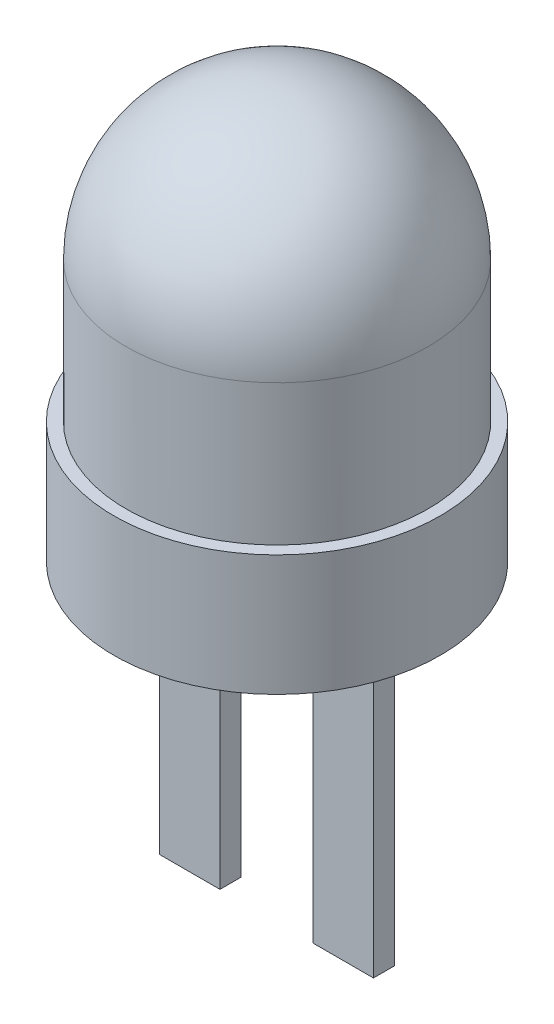
ISO-10303-21;
HEADER;
FILE_DESCRIPTION(('STEP AP214'),'2;1');
FILE_NAME('part.step','',(''),(''),'','','');
FILE_SCHEMA(('AUTOMOTIVE_DESIGN { 1 0 10303 214 1 1 1 1 }'));
ENDSEC;
DATA;
#1=APPLICATION_CONTEXT('core data for automotive mechanical design processes');
#2=APPLICATION_PROTOCOL_DEFINITION('international standard','automotive_design',2000,#1);
#3=PRODUCT_CONTEXT('',#1,'mechanical');
#4=PRODUCT('Part','Part','',(#3));
#5=PRODUCT_RELATED_PRODUCT_CATEGORY('part','',(#4));
#6=PRODUCT_DEFINITION_FORMATION('','',#4);
#7=PRODUCT_DEFINITION_CONTEXT('part definition',#1,'design');
#8=PRODUCT_DEFINITION('design','',#6,#7);
#9=PRODUCT_DEFINITION_SHAPE('','',#8);
#10=(LENGTH_UNIT() NAMED_UNIT(*) SI_UNIT(.MILLI.,.METRE.));
#11=(NAMED_UNIT(*) PLANE_ANGLE_UNIT() SI_UNIT($,.RADIAN.));
#12=(NAMED_UNIT(*) SI_UNIT($,.STERADIAN.) SOLID_ANGLE_UNIT());
#13=UNCERTAINTY_MEASURE_WITH_UNIT(LENGTH_MEASURE(1.E-05),#10,'distance_accuracy_value','');
#14=(GEOMETRIC_REPRESENTATION_CONTEXT(3) GLOBAL_UNCERTAINTY_ASSIGNED_CONTEXT((#13)) GLOBAL_UNIT_ASSIGNED_CONTEXT((#10,
#11,#12)) REPRESENTATION_CONTEXT('',''));
#15=CARTESIAN_POINT('',(0.,0.,0.));
#16=DIRECTION('',(0.,0.,1.));
#17=DIRECTION('',(1.,0.,0.));
#18=AXIS2_PLACEMENT_3D('',#15,#16,#17);
#19=CARTESIAN_POINT('',(0.,0.,0.));
#20=DIRECTION('',(0.,-1.,0.));
#21=DIRECTION('',(0.,0.,-1.));
#22=AXIS2_PLACEMENT_3D('',#19,#20,#21);
#23=PLANE('',#22);
#24=DIRECTION('',(0.,0.,1.));
#25=VECTOR('',#24,1.);
#26=CARTESIAN_POINT('',(-0.77,0.,0.));
#27=LINE('',#26,#25);
#28=CARTESIAN_POINT('',(-0.77,0.,-0.175));
#29=VERTEX_POINT('',#28);
#30=CARTESIAN_POINT('',(-0.77,0.,0.175));
#31=VERTEX_POINT('',#30);
#32=EDGE_CURVE('E11',#29,#31,#27,.T.);
#33=ORIENTED_EDGE('',*,*,#32,.F.);
#34=DIRECTION('',(1.,0.,0.));
#35=VECTOR('',#34,1.);
#36=CARTESIAN_POINT('',(0.,0.,-0.175));
#37=LINE('',#36,#35);
#38=CARTESIAN_POINT('',(-1.77,0.,-0.175));
#39=VERTEX_POINT('',#38);
#40=EDGE_CURVE('E40',#39,#29,#37,.T.);
#41=ORIENTED_EDGE('',*,*,#40,.F.);
#42=DIRECTION('',(0.,0.,-1.));
#43=VECTOR('',#42,1.);
#44=CARTESIAN_POINT('',(-1.77,0.,0.));
#45=LINE('',#44,#43);
#46=CARTESIAN_POINT('',(-1.77,0.,0.175));
#47=VERTEX_POINT('',#46);
#48=EDGE_CURVE('E170',#47,#39,#45,.T.);
#49=ORIENTED_EDGE('',*,*,#48,.F.);
#50=DIRECTION('',(-1.,0.,0.));
#51=VECTOR('',#50,1.);
#52=CARTESIAN_POINT('',(0.,0.,0.175));
#53=LINE('',#52,#51);
#54=EDGE_CURVE('E168',#31,#47,#53,.T.);
#55=ORIENTED_EDGE('',*,*,#54,.F.);
#56=EDGE_LOOP('',(#33,#41,#49,#55));
#57=FACE_BOUND('',#56,.T.);
#58=DIRECTION('',(0.,0.,-1.));
#59=VECTOR('',#58,1.);
#60=CARTESIAN_POINT('',(0.77,0.,0.));
#61=LINE('',#60,#59);
#62=CARTESIAN_POINT('',(0.77,0.,0.175));
#63=VERTEX_POINT('',#62);
#64=CARTESIAN_POINT('',(0.77,0.,-0.175));
#65=VERTEX_POINT('',#64);
#66=EDGE_CURVE('E165',#63,#65,#61,.T.);
#67=ORIENTED_EDGE('',*,*,#66,.F.);
#68=DIRECTION('',(-1.,0.,0.));
#69=VECTOR('',#68,1.);
#70=CARTESIAN_POINT('',(0.,0.,0.175));
#71=LINE('',#70,#69);
#72=CARTESIAN_POINT('',(1.77,0.,0.175));
#73=VERTEX_POINT('',#72);
#74=EDGE_CURVE('E162',#73,#63,#71,.T.);
#75=ORIENTED_EDGE('',*,*,#74,.F.);
#76=DIRECTION('',(0.,0.,1.));
#77=VECTOR('',#76,1.);
#78=CARTESIAN_POINT('',(1.77,0.,0.));
#79=LINE('',#78,#77);
#80=CARTESIAN_POINT('',(1.77,0.,-0.175));
#81=VERTEX_POINT('',#80);
#82=EDGE_CURVE('E159',#81,#73,#79,.T.);
#83=ORIENTED_EDGE('',*,*,#82,.F.);
#84=DIRECTION('',(1.,0.,0.));
#85=VECTOR('',#84,1.);
#86=CARTESIAN_POINT('',(0.,0.,-0.175));
#87=LINE('',#86,#85);
#88=EDGE_CURVE('E156',#65,#81,#87,.T.);
#89=ORIENTED_EDGE('',*,*,#88,.F.);
#90=EDGE_LOOP('',(#67,#75,#83,#89));
#91=FACE_BOUND('',#90,.T.);
#92=CARTESIAN_POINT('',(0.,0.,0.));
#93=DIRECTION('',(0.,-1.,0.));
#94=DIRECTION('',(0.,0.,-1.));
#95=AXIS2_PLACEMENT_3D('',#92,#93,#94);
#96=CIRCLE('',#95,2.7);
#97=CARTESIAN_POINT('',(0.,0.,-2.7));
#98=VERTEX_POINT('',#97);
#99=EDGE_CURVE('E153',#98,#98,#96,.T.);
#100=ORIENTED_EDGE('',*,*,#99,.T.);
#101=EDGE_LOOP('',(#100));
#102=FACE_BOUND('',#101,.T.);
#103=ADVANCED_FACE('F33',(#57,#91,#102),#23,.T.);
#104=CARTESIAN_POINT('',(0.,0.,0.));
#105=DIRECTION('',(0.,-1.,0.));
#106=DIRECTION('',(0.,0.,-1.));
#107=AXIS2_PLACEMENT_3D('',#104,#105,#106);
#108=CYLINDRICAL_SURFACE('',#107,2.7);
#109=CARTESIAN_POINT('',(0.,2.,0.));
#110=DIRECTION('',(0.,-1.,0.));
#111=DIRECTION('',(0.,0.,-1.));
#112=AXIS2_PLACEMENT_3D('',#109,#110,#111);
#113=CIRCLE('',#112,2.7);
#114=CARTESIAN_POINT('',(0.,2.,-2.7));
#115=VERTEX_POINT('',#114);
#116=EDGE_CURVE('E150',#115,#115,#113,.T.);
#117=ORIENTED_EDGE('',*,*,#116,.T.);
#118=EDGE_LOOP('',(#117));
#119=FACE_BOUND('',#118,.T.);
#120=ORIENTED_EDGE('',*,*,#99,.F.);
#121=EDGE_LOOP('',(#120));
#122=FACE_BOUND('',#121,.T.);
#123=ADVANCED_FACE('F178',(#119,#122),#108,.T.);
#124=CARTESIAN_POINT('',(2.7,2.,0.));
#125=DIRECTION('',(0.,1.,0.));
#126=DIRECTION('',(0.,0.,1.));
#127=AXIS2_PLACEMENT_3D('',#124,#125,#126);
#128=PLANE('',#127);
#129=CARTESIAN_POINT('',(0.,2.,0.));
#130=DIRECTION('',(0.,-1.,0.));
#131=DIRECTION('',(0.,0.,-1.));
#132=AXIS2_PLACEMENT_3D('',#129,#130,#131);
#133=CIRCLE('',#132,2.5);
#134=CARTESIAN_POINT('',(0.,2.,-2.5));
#135=VERTEX_POINT('',#134);
#136=EDGE_CURVE('E147',#135,#135,#133,.T.);
#137=ORIENTED_EDGE('',*,*,#136,.T.);
#138=EDGE_LOOP('',(#137));
#139=FACE_BOUND('',#138,.T.);
#140=ORIENTED_EDGE('',*,*,#116,.F.);
#141=EDGE_LOOP('',(#140));
#142=FACE_BOUND('',#141,.T.);
#143=ADVANCED_FACE('F183',(#139,#142),#128,.T.);
#144=CARTESIAN_POINT('',(0.,0.,0.));
#145=DIRECTION('',(0.,-1.,0.));
#146=DIRECTION('',(0.,0.,-1.));
#147=AXIS2_PLACEMENT_3D('',#144,#145,#146);
#148=CYLINDRICAL_SURFACE('',#147,2.5);
#149=CARTESIAN_POINT('',(0.,4.325,0.));
#150=DIRECTION('',(0.,-1.,0.));
#151=DIRECTION('',(0.,0.,-1.));
#152=AXIS2_PLACEMENT_3D('',#149,#150,#151);
#153=CIRCLE('',#152,2.5);
#154=CARTESIAN_POINT('',(0.,4.325,-2.5));
#155=VERTEX_POINT('',#154);
#156=EDGE_CURVE('E139',#155,#155,#153,.T.);
#157=ORIENTED_EDGE('',*,*,#156,.T.);
#158=EDGE_LOOP('',(#157));
#159=FACE_BOUND('',#158,.T.);
#160=ORIENTED_EDGE('',*,*,#136,.F.);
#161=EDGE_LOOP('',(#160));
#162=FACE_BOUND('',#161,.T.);
#163=ADVANCED_FACE('F188',(#159,#162),#148,.T.);
#164=CARTESIAN_POINT('',(0.,4.325,0.));
#165=DIRECTION('',(0.,-1.,0.));
#166=DIRECTION('',(1.,0.,0.));
#167=AXIS2_PLACEMENT_3D('',#164,#165,#166);
#168=SPHERICAL_SURFACE('',#167,2.5);
#169=ORIENTED_EDGE('',*,*,#156,.F.);
#170=EDGE_LOOP('',(#169));
#171=FACE_BOUND('',#170,.T.);
#172=ADVANCED_FACE('F194',(#171),#168,.T.);
#173=CARTESIAN_POINT('',(0.77,5.,0.175));
#174=DIRECTION('',(-1.,0.,0.));
#175=DIRECTION('',(0.,0.,1.));
#176=AXIS2_PLACEMENT_3D('',#173,#174,#175);
#177=PLANE('',#176);
#178=DIRECTION('',(0.,-1.,0.));
#179=VECTOR('',#178,1.);
#180=CARTESIAN_POINT('',(0.77,5.,0.175));
#181=LINE('',#180,#179);
#182=CARTESIAN_POINT('',(0.77,-5.,0.175));
#183=VERTEX_POINT('',#182);
#184=EDGE_CURVE('E137',#63,#183,#181,.T.);
#185=ORIENTED_EDGE('',*,*,#184,.F.);
#186=ORIENTED_EDGE('',*,*,#66,.T.);
#187=DIRECTION('',(0.,-1.,0.));
#188=VECTOR('',#187,1.);
#189=CARTESIAN_POINT('',(0.77,5.,-0.175));
#190=LINE('',#189,#188);
#191=CARTESIAN_POINT('',(0.77,-5.,-0.175));
#192=VERTEX_POINT('',#191);
#193=EDGE_CURVE('E136',#65,#192,#190,.T.);
#194=ORIENTED_EDGE('',*,*,#193,.T.);
#195=DIRECTION('',(0.,0.,-1.));
#196=VECTOR('',#195,1.);
#197=CARTESIAN_POINT('',(0.77,-5.,0.175));
#198=LINE('',#197,#196);
#199=EDGE_CURVE('E121',#183,#192,#198,.T.);
#200=ORIENTED_EDGE('',*,*,#199,.F.);
#201=EDGE_LOOP('',(#185,#186,#194,#200));
#202=FACE_BOUND('',#201,.T.);
#203=ADVANCED_FACE('F198',(#202),#177,.T.);
#204=CARTESIAN_POINT('',(0.77,5.,0.175));
#205=DIRECTION('',(0.,0.,1.));
#206=DIRECTION('',(1.,0.,0.));
#207=AXIS2_PLACEMENT_3D('',#204,#205,#206);
#208=PLANE('',#207);
#209=DIRECTION('',(0.,-1.,0.));
#210=VECTOR('',#209,1.);
#211=CARTESIAN_POINT('',(1.77,5.,0.175));
#212=LINE('',#211,#210);
#213=CARTESIAN_POINT('',(1.77,-5.,0.175));
#214=VERTEX_POINT('',#213);
#215=EDGE_CURVE('E140',#73,#214,#212,.T.);
#216=ORIENTED_EDGE('',*,*,#215,.F.);
#217=ORIENTED_EDGE('',*,*,#74,.T.);
#218=ORIENTED_EDGE('',*,*,#184,.T.);
#219=DIRECTION('',(-1.,0.,0.));
#220=VECTOR('',#219,1.);
#221=CARTESIAN_POINT('',(0.77,-5.,0.175));
#222=LINE('',#221,#220);
#223=EDGE_CURVE('E133',#214,#183,#222,.T.);
#224=ORIENTED_EDGE('',*,*,#223,.F.);
#225=EDGE_LOOP('',(#216,#217,#218,#224));
#226=FACE_BOUND('',#225,.T.);
#227=ADVANCED_FACE('F202',(#226),#208,.T.);
#228=CARTESIAN_POINT('',(1.77,5.,0.175));
#229=DIRECTION('',(1.,0.,0.));
#230=DIRECTION('',(0.,0.,-1.));
#231=AXIS2_PLACEMENT_3D('',#228,#229,#230);
#232=PLANE('',#231);
#233=DIRECTION('',(0.,-1.,0.));
#234=VECTOR('',#233,1.);
#235=CARTESIAN_POINT('',(1.77,5.,-0.175));
#236=LINE('',#235,#234);
#237=CARTESIAN_POINT('',(1.77,-5.,-0.175));
#238=VERTEX_POINT('',#237);
#239=EDGE_CURVE('E142',#81,#238,#236,.T.);
#240=ORIENTED_EDGE('',*,*,#239,.F.);
#241=ORIENTED_EDGE('',*,*,#82,.T.);
#242=ORIENTED_EDGE('',*,*,#215,.T.);
#243=DIRECTION('',(0.,0.,1.));
#244=VECTOR('',#243,1.);
#245=CARTESIAN_POINT('',(1.77,-5.,0.175));
#246=LINE('',#245,#244);
#247=EDGE_CURVE('E130',#238,#214,#246,.T.);
#248=ORIENTED_EDGE('',*,*,#247,.F.);
#249=EDGE_LOOP('',(#240,#241,#242,#248));
#250=FACE_BOUND('',#249,.T.);
#251=ADVANCED_FACE('F208',(#250),#232,.T.);
#252=CARTESIAN_POINT('',(0.77,5.,-0.175));
#253=DIRECTION('',(0.,0.,-1.));
#254=DIRECTION('',(-1.,0.,0.));
#255=AXIS2_PLACEMENT_3D('',#252,#253,#254);
#256=PLANE('',#255);
#257=ORIENTED_EDGE('',*,*,#193,.F.);
#258=ORIENTED_EDGE('',*,*,#88,.T.);
#259=ORIENTED_EDGE('',*,*,#239,.T.);
#260=DIRECTION('',(1.,0.,0.));
#261=VECTOR('',#260,1.);
#262=CARTESIAN_POINT('',(0.77,-5.,-0.175));
#263=LINE('',#262,#261);
#264=EDGE_CURVE('E127',#192,#238,#263,.T.);
#265=ORIENTED_EDGE('',*,*,#264,.F.);
#266=EDGE_LOOP('',(#257,#258,#259,#265));
#267=FACE_BOUND('',#266,.T.);
#268=ADVANCED_FACE('F204',(#267),#256,.T.);
#269=CARTESIAN_POINT('',(0.,-5.,0.));
#270=DIRECTION('',(0.,-1.,0.));
#271=DIRECTION('',(0.,0.,-1.));
#272=AXIS2_PLACEMENT_3D('',#269,#270,#271);
#273=PLANE('',#272);
#274=ORIENTED_EDGE('',*,*,#199,.T.);
#275=ORIENTED_EDGE('',*,*,#264,.T.);
#276=ORIENTED_EDGE('',*,*,#247,.T.);
#277=ORIENTED_EDGE('',*,*,#223,.T.);
#278=EDGE_LOOP('',(#274,#275,#276,#277));
#279=FACE_BOUND('',#278,.T.);
#280=ADVANCED_FACE('F207',(#279),#273,.T.);
#281=CARTESIAN_POINT('',(-0.77,5.,0.175));
#282=DIRECTION('',(1.,0.,0.));
#283=DIRECTION('',(0.,0.,-1.));
#284=AXIS2_PLACEMENT_3D('',#281,#282,#283);
#285=PLANE('',#284);
#286=DIRECTION('',(0.,-1.,0.));
#287=VECTOR('',#286,1.);
#288=CARTESIAN_POINT('',(-0.77,5.,-0.175));
#289=LINE('',#288,#287);
#290=CARTESIAN_POINT('',(-0.77,-5.,-0.175));
#291=VERTEX_POINT('',#290);
#292=EDGE_CURVE('E119',#29,#291,#289,.T.);
#293=ORIENTED_EDGE('',*,*,#292,.F.);
#294=ORIENTED_EDGE('',*,*,#32,.T.);
#295=DIRECTION('',(0.,-1.,0.));
#296=VECTOR('',#295,1.);
#297=CARTESIAN_POINT('',(-0.77,5.,0.175));
#298=LINE('',#297,#296);
#299=CARTESIAN_POINT('',(-0.77,-5.,0.175));
#300=VERTEX_POINT('',#299);
#301=EDGE_CURVE('E92',#31,#300,#298,.T.);
#302=ORIENTED_EDGE('',*,*,#301,.T.);
#303=DIRECTION('',(0.,0.,1.));
#304=VECTOR('',#303,1.);
#305=CARTESIAN_POINT('',(-0.77,-5.,0.175));
#306=LINE('',#305,#304);
#307=EDGE_CURVE('E97',#291,#300,#306,.T.);
#308=ORIENTED_EDGE('',*,*,#307,.F.);
#309=EDGE_LOOP('',(#293,#294,#302,#308));
#310=FACE_BOUND('',#309,.T.);
#311=ADVANCED_FACE('F95',(#310),#285,.T.);
#312=CARTESIAN_POINT('',(-0.77,5.,-0.175));
#313=DIRECTION('',(0.,0.,-1.));
#314=DIRECTION('',(-1.,0.,0.));
#315=AXIS2_PLACEMENT_3D('',#312,#313,#314);
#316=PLANE('',#315);
#317=DIRECTION('',(0.,-1.,0.));
#318=VECTOR('',#317,1.);
#319=CARTESIAN_POINT('',(-1.77,5.,-0.175));
#320=LINE('',#319,#318);
#321=CARTESIAN_POINT('',(-1.77,-5.,-0.175));
#322=VERTEX_POINT('',#321);
#323=EDGE_CURVE('E122',#39,#322,#320,.T.);
#324=ORIENTED_EDGE('',*,*,#323,.F.);
#325=ORIENTED_EDGE('',*,*,#40,.T.);
#326=ORIENTED_EDGE('',*,*,#292,.T.);
#327=DIRECTION('',(1.,0.,0.));
#328=VECTOR('',#327,1.);
#329=CARTESIAN_POINT('',(-0.77,-5.,-0.175));
#330=LINE('',#329,#328);
#331=EDGE_CURVE('E101',#322,#291,#330,.T.);
#332=ORIENTED_EDGE('',*,*,#331,.F.);
#333=EDGE_LOOP('',(#324,#325,#326,#332));
#334=FACE_BOUND('',#333,.T.);
#335=ADVANCED_FACE('F173',(#334),#316,.T.);
#336=CARTESIAN_POINT('',(-1.77,5.,0.175));
#337=DIRECTION('',(-1.,0.,0.));
#338=DIRECTION('',(0.,0.,1.));
#339=AXIS2_PLACEMENT_3D('',#336,#337,#338);
#340=PLANE('',#339);
#341=DIRECTION('',(0.,-1.,0.));
#342=VECTOR('',#341,1.);
#343=CARTESIAN_POINT('',(-1.77,5.,0.175));
#344=LINE('',#343,#342);
#345=CARTESIAN_POINT('',(-1.77,-5.,0.175));
#346=VERTEX_POINT('',#345);
#347=EDGE_CURVE('E100',#47,#346,#344,.T.);
#348=ORIENTED_EDGE('',*,*,#347,.F.);
#349=ORIENTED_EDGE('',*,*,#48,.T.);
#350=ORIENTED_EDGE('',*,*,#323,.T.);
#351=DIRECTION('',(0.,0.,-1.));
#352=VECTOR('',#351,1.);
#353=CARTESIAN_POINT('',(-1.77,-5.,0.175));
#354=LINE('',#353,#352);
#355=EDGE_CURVE('E110',#346,#322,#354,.T.);
#356=ORIENTED_EDGE('',*,*,#355,.F.);
#357=EDGE_LOOP('',(#348,#349,#350,#356));
#358=FACE_BOUND('',#357,.T.);
#359=ADVANCED_FACE('F175',(#358),#340,.T.);
#360=CARTESIAN_POINT('',(-0.77,5.,0.175));
#361=DIRECTION('',(0.,0.,1.));
#362=DIRECTION('',(1.,0.,0.));
#363=AXIS2_PLACEMENT_3D('',#360,#361,#362);
#364=PLANE('',#363);
#365=ORIENTED_EDGE('',*,*,#301,.F.);
#366=ORIENTED_EDGE('',*,*,#54,.T.);
#367=ORIENTED_EDGE('',*,*,#347,.T.);
#368=DIRECTION('',(-1.,0.,0.));
#369=VECTOR('',#368,1.);
#370=CARTESIAN_POINT('',(-0.77,-5.,0.175));
#371=LINE('',#370,#369);
#372=EDGE_CURVE('E104',#300,#346,#371,.T.);
#373=ORIENTED_EDGE('',*,*,#372,.F.);
#374=EDGE_LOOP('',(#365,#366,#367,#373));
#375=FACE_BOUND('',#374,.T.);
#376=ADVANCED_FACE('F105',(#375),#364,.T.);
#377=CARTESIAN_POINT('',(0.,-5.,0.));
#378=DIRECTION('',(0.,1.,0.));
#379=DIRECTION('',(0.,0.,1.));
#380=AXIS2_PLACEMENT_3D('',#377,#378,#379);
#381=PLANE('',#380);
#382=ORIENTED_EDGE('',*,*,#307,.T.);
#383=ORIENTED_EDGE('',*,*,#372,.T.);
#384=ORIENTED_EDGE('',*,*,#355,.T.);
#385=ORIENTED_EDGE('',*,*,#331,.T.);
#386=EDGE_LOOP('',(#382,#383,#384,#385));
#387=FACE_BOUND('',#386,.T.);
#388=ADVANCED_FACE('F113',(#387),#381,.F.);
#389=CLOSED_SHELL('',(#103,#123,#143,#163,#172,#203,#227,#251,#268,#280,#311,#335,#359,#376,#388));
#390=MANIFOLD_SOLID_BREP('B2',#389);
#391=ADVANCED_BREP_SHAPE_REPRESENTATION('',(#18,#390),#14);
#392=SHAPE_DEFINITION_REPRESENTATION(#9,#391);
ENDSEC;
END-ISO-10303-21;
